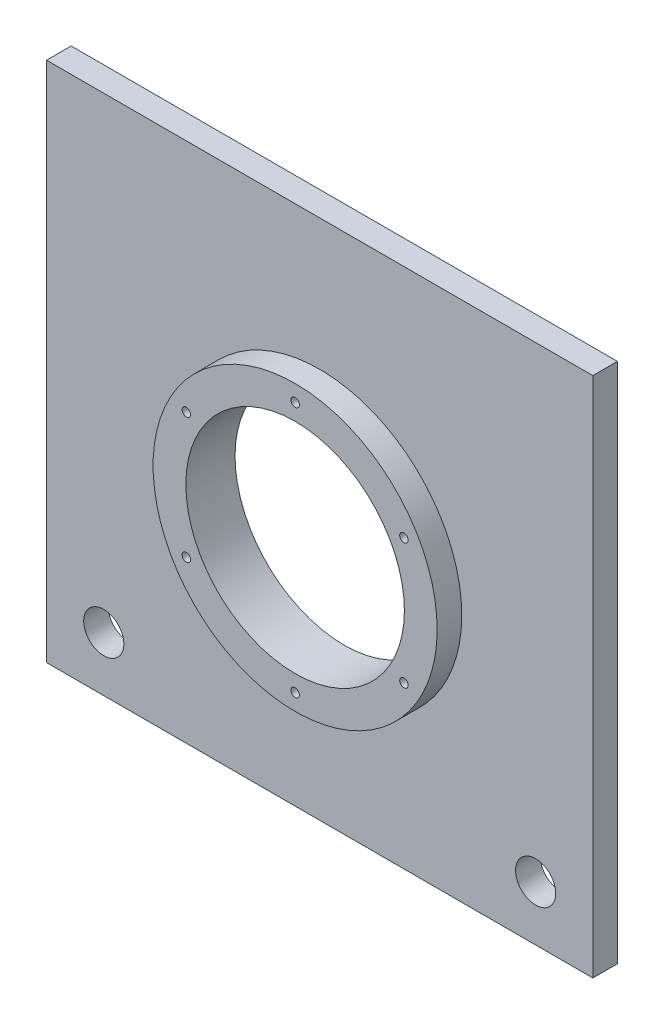
ISO-10303-21;
HEADER;
FILE_DESCRIPTION(('STEP AP214'),'2;1');
FILE_NAME('part.step','',(''),(''),'','','');
FILE_SCHEMA(('AUTOMOTIVE_DESIGN { 1 0 10303 214 1 1 1 1 }'));
ENDSEC;
DATA;
#1=APPLICATION_CONTEXT('core data for automotive mechanical design processes');
#2=APPLICATION_PROTOCOL_DEFINITION('international standard','automotive_design',2000,#1);
#3=PRODUCT_CONTEXT('',#1,'mechanical');
#4=PRODUCT('Part','Part','',(#3));
#5=PRODUCT_RELATED_PRODUCT_CATEGORY('part','',(#4));
#6=PRODUCT_DEFINITION_FORMATION('','',#4);
#7=PRODUCT_DEFINITION_CONTEXT('part definition',#1,'design');
#8=PRODUCT_DEFINITION('design','',#6,#7);
#9=PRODUCT_DEFINITION_SHAPE('','',#8);
#10=(LENGTH_UNIT() NAMED_UNIT(*) SI_UNIT(.MILLI.,.METRE.));
#11=(NAMED_UNIT(*) PLANE_ANGLE_UNIT() SI_UNIT($,.RADIAN.));
#12=(NAMED_UNIT(*) SI_UNIT($,.STERADIAN.) SOLID_ANGLE_UNIT());
#13=UNCERTAINTY_MEASURE_WITH_UNIT(LENGTH_MEASURE(1.E-05),#10,'distance_accuracy_value','');
#14=(GEOMETRIC_REPRESENTATION_CONTEXT(3) GLOBAL_UNCERTAINTY_ASSIGNED_CONTEXT((#13)) GLOBAL_UNIT_ASSIGNED_CONTEXT((#10,
#11,#12)) REPRESENTATION_CONTEXT('',''));
#15=CARTESIAN_POINT('',(0.,0.,0.));
#16=DIRECTION('',(0.,0.,1.));
#17=DIRECTION('',(1.,0.,0.));
#18=AXIS2_PLACEMENT_3D('',#15,#16,#17);
#19=CARTESIAN_POINT('',(0.,0.,9.));
#20=DIRECTION('',(0.,0.,1.));
#21=DIRECTION('',(1.,0.,0.));
#22=AXIS2_PLACEMENT_3D('',#19,#20,#21);
#23=PLANE('',#22);
#24=CARTESIAN_POINT('',(79.0575916230372,-75.4999999999996,9.));
#25=DIRECTION('',(0.,0.,1.));
#26=DIRECTION('',(-1.,0.,0.));
#27=AXIS2_PLACEMENT_3D('',#24,#25,#26);
#28=CIRCLE('',#27,7.34999999999999);
#29=CARTESIAN_POINT('',(71.7075916230372,-75.4999999999996,9.));
#30=VERTEX_POINT('',#29);
#31=EDGE_CURVE('E149',#30,#30,#28,.T.);
#32=ORIENTED_EDGE('',*,*,#31,.F.);
#33=EDGE_LOOP('',(#32));
#34=FACE_BOUND('',#33,.T.);
#35=DIRECTION('',(0.,1.,0.));
#36=VECTOR('',#35,1.);
#37=CARTESIAN_POINT('',(100.,95.5,9.));
#38=LINE('',#37,#36);
#39=CARTESIAN_POINT('',(100.,-95.5,9.));
#40=VERTEX_POINT('',#39);
#41=CARTESIAN_POINT('',(100.,95.5,9.));
#42=VERTEX_POINT('',#41);
#43=EDGE_CURVE('E98',#40,#42,#38,.T.);
#44=ORIENTED_EDGE('',*,*,#43,.T.);
#45=DIRECTION('',(-1.,0.,0.));
#46=VECTOR('',#45,1.);
#47=CARTESIAN_POINT('',(-100.,95.5,9.));
#48=LINE('',#47,#46);
#49=CARTESIAN_POINT('',(-100.,95.5,9.));
#50=VERTEX_POINT('',#49);
#51=EDGE_CURVE('E93',#42,#50,#48,.T.);
#52=ORIENTED_EDGE('',*,*,#51,.T.);
#53=DIRECTION('',(0.,-1.,0.));
#54=VECTOR('',#53,1.);
#55=CARTESIAN_POINT('',(-100.,95.5,9.));
#56=LINE('',#55,#54);
#57=CARTESIAN_POINT('',(-100.,-95.5,9.));
#58=VERTEX_POINT('',#57);
#59=EDGE_CURVE('E96',#50,#58,#56,.T.);
#60=ORIENTED_EDGE('',*,*,#59,.T.);
#61=DIRECTION('',(1.,0.,0.));
#62=VECTOR('',#61,1.);
#63=CARTESIAN_POINT('',(-100.,-95.5,9.));
#64=LINE('',#63,#62);
#65=EDGE_CURVE('E63',#58,#40,#64,.T.);
#66=ORIENTED_EDGE('',*,*,#65,.T.);
#67=EDGE_LOOP('',(#44,#52,#60,#66));
#68=FACE_BOUND('',#67,.T.);
#69=CARTESIAN_POINT('',(-79.0575916230366,-75.5,9.));
#70=DIRECTION('',(0.,0.,1.));
#71=DIRECTION('',(1.,0.,0.));
#72=AXIS2_PLACEMENT_3D('',#69,#70,#71);
#73=CIRCLE('',#72,7.34999999999999);
#74=CARTESIAN_POINT('',(-71.7075916230366,-75.5,9.));
#75=VERTEX_POINT('',#74);
#76=EDGE_CURVE('E142',#75,#75,#73,.T.);
#77=ORIENTED_EDGE('',*,*,#76,.F.);
#78=EDGE_LOOP('',(#77));
#79=FACE_BOUND('',#78,.T.);
#80=CARTESIAN_POINT('',(0.,-4.5,9.));
#81=DIRECTION('',(0.,0.,1.));
#82=DIRECTION('',(1.,0.,0.));
#83=AXIS2_PLACEMENT_3D('',#80,#81,#82);
#84=CIRCLE('',#83,52.);
#85=CARTESIAN_POINT('',(52.,-4.5,9.));
#86=VERTEX_POINT('',#85);
#87=EDGE_CURVE('E159',#86,#86,#84,.T.);
#88=ORIENTED_EDGE('',*,*,#87,.F.);
#89=EDGE_LOOP('',(#88));
#90=FACE_BOUND('',#89,.T.);
#91=ADVANCED_FACE('F46',(#34,#68,#79,#90),#23,.T.);
#92=CARTESIAN_POINT('',(0.,0.,0.));
#93=DIRECTION('',(0.,0.,1.));
#94=DIRECTION('',(1.,0.,0.));
#95=AXIS2_PLACEMENT_3D('',#92,#93,#94);
#96=PLANE('',#95);
#97=DIRECTION('',(0.,1.,0.));
#98=VECTOR('',#97,1.);
#99=CARTESIAN_POINT('',(100.,95.5,0.));
#100=LINE('',#99,#98);
#101=CARTESIAN_POINT('',(100.,-95.5,0.));
#102=VERTEX_POINT('',#101);
#103=CARTESIAN_POINT('',(100.,95.5,0.));
#104=VERTEX_POINT('',#103);
#105=EDGE_CURVE('E110',#102,#104,#100,.T.);
#106=ORIENTED_EDGE('',*,*,#105,.F.);
#107=DIRECTION('',(1.,0.,0.));
#108=VECTOR('',#107,1.);
#109=CARTESIAN_POINT('',(-100.,-95.5,0.));
#110=LINE('',#109,#108);
#111=CARTESIAN_POINT('',(-100.,-95.5,0.));
#112=VERTEX_POINT('',#111);
#113=EDGE_CURVE('E86',#112,#102,#110,.T.);
#114=ORIENTED_EDGE('',*,*,#113,.F.);
#115=DIRECTION('',(0.,-1.,0.));
#116=VECTOR('',#115,1.);
#117=CARTESIAN_POINT('',(-100.,95.5,0.));
#118=LINE('',#117,#116);
#119=CARTESIAN_POINT('',(-100.,95.5,0.));
#120=VERTEX_POINT('',#119);
#121=EDGE_CURVE('E80',#120,#112,#118,.T.);
#122=ORIENTED_EDGE('',*,*,#121,.F.);
#123=DIRECTION('',(-1.,0.,0.));
#124=VECTOR('',#123,1.);
#125=CARTESIAN_POINT('',(-100.,95.5,0.));
#126=LINE('',#125,#124);
#127=EDGE_CURVE('E102',#104,#120,#126,.T.);
#128=ORIENTED_EDGE('',*,*,#127,.F.);
#129=EDGE_LOOP('',(#106,#114,#122,#128));
#130=FACE_BOUND('',#129,.T.);
#131=CARTESIAN_POINT('',(0.,-4.5,0.));
#132=DIRECTION('',(0.,0.,1.));
#133=DIRECTION('',(1.,0.,0.));
#134=AXIS2_PLACEMENT_3D('',#131,#132,#133);
#135=CIRCLE('',#134,40.);
#136=CARTESIAN_POINT('',(40.,-4.5,0.));
#137=VERTEX_POINT('',#136);
#138=EDGE_CURVE('E115',#137,#137,#135,.T.);
#139=ORIENTED_EDGE('',*,*,#138,.T.);
#140=EDGE_LOOP('',(#139));
#141=FACE_BOUND('',#140,.T.);
#142=CARTESIAN_POINT('',(-79.0575916230366,-75.5,0.));
#143=DIRECTION('',(0.,0.,1.));
#144=DIRECTION('',(1.,0.,0.));
#145=AXIS2_PLACEMENT_3D('',#142,#143,#144);
#146=CIRCLE('',#145,7.34999999999999);
#147=CARTESIAN_POINT('',(-71.7075916230366,-75.5,0.));
#148=VERTEX_POINT('',#147);
#149=EDGE_CURVE('E143',#148,#148,#146,.T.);
#150=ORIENTED_EDGE('',*,*,#149,.T.);
#151=EDGE_LOOP('',(#150));
#152=FACE_BOUND('',#151,.T.);
#153=CARTESIAN_POINT('',(79.0575916230372,-75.4999999999996,0.));
#154=DIRECTION('',(0.,0.,1.));
#155=DIRECTION('',(-1.,0.,0.));
#156=AXIS2_PLACEMENT_3D('',#153,#154,#155);
#157=CIRCLE('',#156,7.34999999999999);
#158=CARTESIAN_POINT('',(71.7075916230372,-75.4999999999996,0.));
#159=VERTEX_POINT('',#158);
#160=EDGE_CURVE('E151',#159,#159,#157,.T.);
#161=ORIENTED_EDGE('',*,*,#160,.T.);
#162=EDGE_LOOP('',(#161));
#163=FACE_BOUND('',#162,.T.);
#164=ADVANCED_FACE('F134',(#130,#141,#152,#163),#96,.F.);
#165=CARTESIAN_POINT('',(100.,95.5,9.));
#166=DIRECTION('',(-1.,0.,0.));
#167=DIRECTION('',(0.,-1.,0.));
#168=AXIS2_PLACEMENT_3D('',#165,#166,#167);
#169=PLANE('',#168);
#170=ORIENTED_EDGE('',*,*,#105,.T.);
#171=DIRECTION('',(0.,0.,-1.));
#172=VECTOR('',#171,1.);
#173=CARTESIAN_POINT('',(100.,95.5,9.));
#174=LINE('',#173,#172);
#175=EDGE_CURVE('E12',#42,#104,#174,.T.);
#176=ORIENTED_EDGE('',*,*,#175,.F.);
#177=ORIENTED_EDGE('',*,*,#43,.F.);
#178=DIRECTION('',(0.,0.,-1.));
#179=VECTOR('',#178,1.);
#180=CARTESIAN_POINT('',(100.,-95.5,9.));
#181=LINE('',#180,#179);
#182=EDGE_CURVE('E106',#40,#102,#181,.T.);
#183=ORIENTED_EDGE('',*,*,#182,.T.);
#184=EDGE_LOOP('',(#170,#176,#177,#183));
#185=FACE_BOUND('',#184,.T.);
#186=ADVANCED_FACE('F48',(#185),#169,.F.);
#187=CARTESIAN_POINT('',(-100.,95.5,9.));
#188=DIRECTION('',(0.,-1.,0.));
#189=DIRECTION('',(0.,0.,-1.));
#190=AXIS2_PLACEMENT_3D('',#187,#188,#189);
#191=PLANE('',#190);
#192=ORIENTED_EDGE('',*,*,#127,.T.);
#193=DIRECTION('',(0.,0.,-1.));
#194=VECTOR('',#193,1.);
#195=CARTESIAN_POINT('',(-100.,95.5,9.));
#196=LINE('',#195,#194);
#197=EDGE_CURVE('E55',#50,#120,#196,.T.);
#198=ORIENTED_EDGE('',*,*,#197,.F.);
#199=ORIENTED_EDGE('',*,*,#51,.F.);
#200=ORIENTED_EDGE('',*,*,#175,.T.);
#201=EDGE_LOOP('',(#192,#198,#199,#200));
#202=FACE_BOUND('',#201,.T.);
#203=ADVANCED_FACE('F101',(#202),#191,.F.);
#204=CARTESIAN_POINT('',(-100.,95.5,9.));
#205=DIRECTION('',(1.,0.,0.));
#206=DIRECTION('',(0.,1.,0.));
#207=AXIS2_PLACEMENT_3D('',#204,#205,#206);
#208=PLANE('',#207);
#209=ORIENTED_EDGE('',*,*,#121,.T.);
#210=DIRECTION('',(0.,0.,-1.));
#211=VECTOR('',#210,1.);
#212=CARTESIAN_POINT('',(-100.,-95.5,9.));
#213=LINE('',#212,#211);
#214=EDGE_CURVE('E103',#58,#112,#213,.T.);
#215=ORIENTED_EDGE('',*,*,#214,.F.);
#216=ORIENTED_EDGE('',*,*,#59,.F.);
#217=ORIENTED_EDGE('',*,*,#197,.T.);
#218=EDGE_LOOP('',(#209,#215,#216,#217));
#219=FACE_BOUND('',#218,.T.);
#220=ADVANCED_FACE('F104',(#219),#208,.F.);
#221=CARTESIAN_POINT('',(-100.,-95.5,9.));
#222=DIRECTION('',(0.,1.,0.));
#223=DIRECTION('',(0.,0.,1.));
#224=AXIS2_PLACEMENT_3D('',#221,#222,#223);
#225=PLANE('',#224);
#226=ORIENTED_EDGE('',*,*,#113,.T.);
#227=ORIENTED_EDGE('',*,*,#182,.F.);
#228=ORIENTED_EDGE('',*,*,#65,.F.);
#229=ORIENTED_EDGE('',*,*,#214,.T.);
#230=EDGE_LOOP('',(#226,#227,#228,#229));
#231=FACE_BOUND('',#230,.T.);
#232=ADVANCED_FACE('F131',(#231),#225,.F.);
#233=CARTESIAN_POINT('',(0.,-4.5,9.));
#234=DIRECTION('',(0.,0.,-1.));
#235=DIRECTION('',(-1.,0.,0.));
#236=AXIS2_PLACEMENT_3D('',#233,#234,#235);
#237=CYLINDRICAL_SURFACE('',#236,40.);
#238=ORIENTED_EDGE('',*,*,#138,.F.);
#239=EDGE_LOOP('',(#238));
#240=FACE_BOUND('',#239,.T.);
#241=CARTESIAN_POINT('',(0.,-4.5,18.));
#242=DIRECTION('',(0.,0.,1.));
#243=DIRECTION('',(1.,0.,0.));
#244=AXIS2_PLACEMENT_3D('',#241,#242,#243);
#245=CIRCLE('',#244,40.);
#246=CARTESIAN_POINT('',(40.,-4.5,18.));
#247=VERTEX_POINT('',#246);
#248=EDGE_CURVE('E162',#247,#247,#245,.T.);
#249=ORIENTED_EDGE('',*,*,#248,.T.);
#250=EDGE_LOOP('',(#249));
#251=FACE_BOUND('',#250,.T.);
#252=ADVANCED_FACE('F230',(#240,#251),#237,.F.);
#253=CARTESIAN_POINT('',(-79.0575916230366,-75.5,9.));
#254=DIRECTION('',(0.,0.,-1.));
#255=DIRECTION('',(-1.,0.,0.));
#256=AXIS2_PLACEMENT_3D('',#253,#254,#255);
#257=CYLINDRICAL_SURFACE('',#256,7.34999999999999);
#258=ORIENTED_EDGE('',*,*,#76,.T.);
#259=EDGE_LOOP('',(#258));
#260=FACE_BOUND('',#259,.T.);
#261=ORIENTED_EDGE('',*,*,#149,.F.);
#262=EDGE_LOOP('',(#261));
#263=FACE_BOUND('',#262,.T.);
#264=ADVANCED_FACE('F246',(#260,#263),#257,.F.);
#265=CARTESIAN_POINT('',(79.0575916230372,-75.4999999999996,9.));
#266=DIRECTION('',(0.,0.,-1.));
#267=DIRECTION('',(-1.,0.,0.));
#268=AXIS2_PLACEMENT_3D('',#265,#266,#267);
#269=CYLINDRICAL_SURFACE('',#268,7.34999999999999);
#270=ORIENTED_EDGE('',*,*,#31,.T.);
#271=EDGE_LOOP('',(#270));
#272=FACE_BOUND('',#271,.T.);
#273=ORIENTED_EDGE('',*,*,#160,.F.);
#274=EDGE_LOOP('',(#273));
#275=FACE_BOUND('',#274,.T.);
#276=ADVANCED_FACE('F235',(#272,#275),#269,.F.);
#277=CARTESIAN_POINT('',(0.,-4.5,18.));
#278=DIRECTION('',(0.,0.,1.));
#279=DIRECTION('',(1.,0.,0.));
#280=AXIS2_PLACEMENT_3D('',#277,#278,#279);
#281=PLANE('',#280);
#282=CARTESIAN_POINT('',(6.89507804351655E-10,41.5,18.));
#283=DIRECTION('',(0.,0.,1.));
#284=DIRECTION('',(1.,0.,0.));
#285=AXIS2_PLACEMENT_3D('',#282,#283,#284);
#286=CIRCLE('',#285,1.55);
#287=CARTESIAN_POINT('',(1.55000000068951,41.5,18.));
#288=VERTEX_POINT('',#287);
#289=EDGE_CURVE('E179',#288,#288,#286,.T.);
#290=ORIENTED_EDGE('',*,*,#289,.F.);
#291=EDGE_LOOP('',(#290));
#292=FACE_BOUND('',#291,.T.);
#293=CARTESIAN_POINT('',(-39.8371685740842,18.5,18.));
#294=DIRECTION('',(0.,0.,1.));
#295=DIRECTION('',(1.,0.,0.));
#296=AXIS2_PLACEMENT_3D('',#293,#294,#295);
#297=CIRCLE('',#296,1.55);
#298=CARTESIAN_POINT('',(-38.2871685740842,18.5,18.));
#299=VERTEX_POINT('',#298);
#300=EDGE_CURVE('E208',#299,#299,#297,.T.);
#301=ORIENTED_EDGE('',*,*,#300,.F.);
#302=EDGE_LOOP('',(#301));
#303=FACE_BOUND('',#302,.T.);
#304=CARTESIAN_POINT('',(-39.8371685740842,-27.5,18.));
#305=DIRECTION('',(0.,0.,1.));
#306=DIRECTION('',(1.,0.,0.));
#307=AXIS2_PLACEMENT_3D('',#304,#305,#306);
#308=CIRCLE('',#307,1.55);
#309=CARTESIAN_POINT('',(-38.2871685740842,-27.5,18.));
#310=VERTEX_POINT('',#309);
#311=EDGE_CURVE('E202',#310,#310,#308,.T.);
#312=ORIENTED_EDGE('',*,*,#311,.F.);
#313=EDGE_LOOP('',(#312));
#314=FACE_BOUND('',#313,.T.);
#315=CARTESIAN_POINT('',(0.,-50.5,18.));
#316=DIRECTION('',(0.,0.,1.));
#317=DIRECTION('',(1.,0.,0.));
#318=AXIS2_PLACEMENT_3D('',#315,#316,#317);
#319=CIRCLE('',#318,1.55);
#320=CARTESIAN_POINT('',(1.55,-50.5,18.));
#321=VERTEX_POINT('',#320);
#322=EDGE_CURVE('E192',#321,#321,#319,.T.);
#323=ORIENTED_EDGE('',*,*,#322,.F.);
#324=EDGE_LOOP('',(#323));
#325=FACE_BOUND('',#324,.T.);
#326=CARTESIAN_POINT('',(39.8371685740842,-27.5,18.));
#327=DIRECTION('',(0.,0.,1.));
#328=DIRECTION('',(1.,0.,0.));
#329=AXIS2_PLACEMENT_3D('',#326,#327,#328);
#330=CIRCLE('',#329,1.55);
#331=CARTESIAN_POINT('',(41.3871685740842,-27.5,18.));
#332=VERTEX_POINT('',#331);
#333=EDGE_CURVE('E184',#332,#332,#330,.T.);
#334=ORIENTED_EDGE('',*,*,#333,.F.);
#335=EDGE_LOOP('',(#334));
#336=FACE_BOUND('',#335,.T.);
#337=CARTESIAN_POINT('',(39.8371685740842,18.5,18.));
#338=DIRECTION('',(0.,0.,1.));
#339=DIRECTION('',(1.,0.,0.));
#340=AXIS2_PLACEMENT_3D('',#337,#338,#339);
#341=CIRCLE('',#340,1.55);
#342=CARTESIAN_POINT('',(41.3871685740842,18.5,18.));
#343=VERTEX_POINT('',#342);
#344=EDGE_CURVE('E173',#343,#343,#341,.T.);
#345=ORIENTED_EDGE('',*,*,#344,.F.);
#346=EDGE_LOOP('',(#345));
#347=FACE_BOUND('',#346,.T.);
#348=CARTESIAN_POINT('',(0.,-4.5,18.));
#349=DIRECTION('',(0.,0.,1.));
#350=DIRECTION('',(1.,0.,0.));
#351=AXIS2_PLACEMENT_3D('',#348,#349,#350);
#352=CIRCLE('',#351,52.);
#353=CARTESIAN_POINT('',(52.,-4.5,18.));
#354=VERTEX_POINT('',#353);
#355=EDGE_CURVE('E156',#354,#354,#352,.T.);
#356=ORIENTED_EDGE('',*,*,#355,.T.);
#357=EDGE_LOOP('',(#356));
#358=FACE_BOUND('',#357,.T.);
#359=ORIENTED_EDGE('',*,*,#248,.F.);
#360=EDGE_LOOP('',(#359));
#361=FACE_BOUND('',#360,.T.);
#362=ADVANCED_FACE('F232',(#292,#303,#314,#325,#336,#347,#358,#361),#281,.T.);
#363=CARTESIAN_POINT('',(0.,-4.5,18.));
#364=DIRECTION('',(0.,0.,-1.));
#365=DIRECTION('',(-1.,0.,0.));
#366=AXIS2_PLACEMENT_3D('',#363,#364,#365);
#367=CYLINDRICAL_SURFACE('',#366,52.);
#368=ORIENTED_EDGE('',*,*,#355,.F.);
#369=EDGE_LOOP('',(#368));
#370=FACE_BOUND('',#369,.T.);
#371=ORIENTED_EDGE('',*,*,#87,.T.);
#372=EDGE_LOOP('',(#371));
#373=FACE_BOUND('',#372,.T.);
#374=ADVANCED_FACE('F234',(#370,#373),#367,.T.);
#375=CARTESIAN_POINT('',(39.8371685740842,18.5,9.));
#376=DIRECTION('',(0.,0.,1.));
#377=DIRECTION('',(1.,0.,0.));
#378=AXIS2_PLACEMENT_3D('',#375,#376,#377);
#379=CYLINDRICAL_SURFACE('',#378,1.55);
#380=CARTESIAN_POINT('',(39.8371685740842,18.5,9.));
#381=DIRECTION('',(0.,0.,1.));
#382=DIRECTION('',(1.,0.,0.));
#383=AXIS2_PLACEMENT_3D('',#380,#381,#382);
#384=CIRCLE('',#383,1.55);
#385=CARTESIAN_POINT('',(41.3871685740842,18.5,9.));
#386=VERTEX_POINT('',#385);
#387=EDGE_CURVE('E180',#386,#386,#384,.T.);
#388=ORIENTED_EDGE('',*,*,#387,.F.);
#389=EDGE_LOOP('',(#388));
#390=FACE_BOUND('',#389,.T.);
#391=ORIENTED_EDGE('',*,*,#344,.T.);
#392=EDGE_LOOP('',(#391));
#393=FACE_BOUND('',#392,.T.);
#394=ADVANCED_FACE('F242',(#390,#393),#379,.F.);
#395=CARTESIAN_POINT('',(39.8371685740842,18.5,9.));
#396=DIRECTION('',(0.,0.,1.));
#397=DIRECTION('',(1.,0.,0.));
#398=AXIS2_PLACEMENT_3D('',#395,#396,#397);
#399=PLANE('',#398);
#400=ORIENTED_EDGE('',*,*,#387,.T.);
#401=EDGE_LOOP('',(#400));
#402=FACE_BOUND('',#401,.T.);
#403=ADVANCED_FACE('F333',(#402),#399,.T.);
#404=CARTESIAN_POINT('',(39.8371685740842,-27.5,9.));
#405=DIRECTION('',(0.,0.,1.));
#406=DIRECTION('',(1.,0.,0.));
#407=AXIS2_PLACEMENT_3D('',#404,#405,#406);
#408=CYLINDRICAL_SURFACE('',#407,1.55);
#409=CARTESIAN_POINT('',(39.8371685740842,-27.5,9.));
#410=DIRECTION('',(0.,0.,1.));
#411=DIRECTION('',(1.,0.,0.));
#412=AXIS2_PLACEMENT_3D('',#409,#410,#411);
#413=CIRCLE('',#412,1.55);
#414=CARTESIAN_POINT('',(41.3871685740842,-27.5,9.));
#415=VERTEX_POINT('',#414);
#416=EDGE_CURVE('E189',#415,#415,#413,.T.);
#417=ORIENTED_EDGE('',*,*,#416,.F.);
#418=EDGE_LOOP('',(#417));
#419=FACE_BOUND('',#418,.T.);
#420=ORIENTED_EDGE('',*,*,#333,.T.);
#421=EDGE_LOOP('',(#420));
#422=FACE_BOUND('',#421,.T.);
#423=ADVANCED_FACE('F342',(#419,#422),#408,.F.);
#424=CARTESIAN_POINT('',(39.8371685740842,-27.5,9.));
#425=DIRECTION('',(0.,0.,1.));
#426=DIRECTION('',(1.,0.,0.));
#427=AXIS2_PLACEMENT_3D('',#424,#425,#426);
#428=PLANE('',#427);
#429=ORIENTED_EDGE('',*,*,#416,.T.);
#430=EDGE_LOOP('',(#429));
#431=FACE_BOUND('',#430,.T.);
#432=ADVANCED_FACE('F351',(#431),#428,.T.);
#433=CARTESIAN_POINT('',(0.,-50.5,9.));
#434=DIRECTION('',(0.,0.,1.));
#435=DIRECTION('',(1.,0.,0.));
#436=AXIS2_PLACEMENT_3D('',#433,#434,#435);
#437=CYLINDRICAL_SURFACE('',#436,1.55);
#438=CARTESIAN_POINT('',(0.,-50.5,9.));
#439=DIRECTION('',(0.,0.,1.));
#440=DIRECTION('',(1.,0.,0.));
#441=AXIS2_PLACEMENT_3D('',#438,#439,#440);
#442=CIRCLE('',#441,1.55);
#443=CARTESIAN_POINT('',(1.55,-50.5,9.));
#444=VERTEX_POINT('',#443);
#445=EDGE_CURVE('E197',#444,#444,#442,.T.);
#446=ORIENTED_EDGE('',*,*,#445,.F.);
#447=EDGE_LOOP('',(#446));
#448=FACE_BOUND('',#447,.T.);
#449=ORIENTED_EDGE('',*,*,#322,.T.);
#450=EDGE_LOOP('',(#449));
#451=FACE_BOUND('',#450,.T.);
#452=ADVANCED_FACE('F360',(#448,#451),#437,.F.);
#453=CARTESIAN_POINT('',(0.,-50.5,9.));
#454=DIRECTION('',(0.,0.,1.));
#455=DIRECTION('',(1.,0.,0.));
#456=AXIS2_PLACEMENT_3D('',#453,#454,#455);
#457=PLANE('',#456);
#458=ORIENTED_EDGE('',*,*,#445,.T.);
#459=EDGE_LOOP('',(#458));
#460=FACE_BOUND('',#459,.T.);
#461=ADVANCED_FACE('F369',(#460),#457,.T.);
#462=CARTESIAN_POINT('',(-39.8371685740842,-27.5,9.));
#463=DIRECTION('',(0.,0.,1.));
#464=DIRECTION('',(1.,0.,0.));
#465=AXIS2_PLACEMENT_3D('',#462,#463,#464);
#466=CYLINDRICAL_SURFACE('',#465,1.55);
#467=CARTESIAN_POINT('',(-39.8371685740842,-27.5,9.));
#468=DIRECTION('',(0.,0.,1.));
#469=DIRECTION('',(1.,0.,0.));
#470=AXIS2_PLACEMENT_3D('',#467,#468,#469);
#471=CIRCLE('',#470,1.55);
#472=CARTESIAN_POINT('',(-38.2871685740842,-27.5,9.));
#473=VERTEX_POINT('',#472);
#474=EDGE_CURVE('E206',#473,#473,#471,.T.);
#475=ORIENTED_EDGE('',*,*,#474,.F.);
#476=EDGE_LOOP('',(#475));
#477=FACE_BOUND('',#476,.T.);
#478=ORIENTED_EDGE('',*,*,#311,.T.);
#479=EDGE_LOOP('',(#478));
#480=FACE_BOUND('',#479,.T.);
#481=ADVANCED_FACE('F378',(#477,#480),#466,.F.);
#482=CARTESIAN_POINT('',(-39.8371685740842,-27.5,9.));
#483=DIRECTION('',(0.,0.,1.));
#484=DIRECTION('',(1.,0.,0.));
#485=AXIS2_PLACEMENT_3D('',#482,#483,#484);
#486=PLANE('',#485);
#487=ORIENTED_EDGE('',*,*,#474,.T.);
#488=EDGE_LOOP('',(#487));
#489=FACE_BOUND('',#488,.T.);
#490=ADVANCED_FACE('F387',(#489),#486,.T.);
#491=CARTESIAN_POINT('',(-39.8371685740842,18.5,9.));
#492=DIRECTION('',(0.,0.,1.));
#493=DIRECTION('',(1.,0.,0.));
#494=AXIS2_PLACEMENT_3D('',#491,#492,#493);
#495=CYLINDRICAL_SURFACE('',#494,1.55);
#496=CARTESIAN_POINT('',(-39.8371685740842,18.5,9.));
#497=DIRECTION('',(0.,0.,1.));
#498=DIRECTION('',(1.,0.,0.));
#499=AXIS2_PLACEMENT_3D('',#496,#497,#498);
#500=CIRCLE('',#499,1.55);
#501=CARTESIAN_POINT('',(-38.2871685740842,18.5,9.));
#502=VERTEX_POINT('',#501);
#503=EDGE_CURVE('E181',#502,#502,#500,.T.);
#504=ORIENTED_EDGE('',*,*,#503,.F.);
#505=EDGE_LOOP('',(#504));
#506=FACE_BOUND('',#505,.T.);
#507=ORIENTED_EDGE('',*,*,#300,.T.);
#508=EDGE_LOOP('',(#507));
#509=FACE_BOUND('',#508,.T.);
#510=ADVANCED_FACE('F396',(#506,#509),#495,.F.);
#511=CARTESIAN_POINT('',(-39.8371685740842,18.5,9.));
#512=DIRECTION('',(0.,0.,1.));
#513=DIRECTION('',(1.,0.,0.));
#514=AXIS2_PLACEMENT_3D('',#511,#512,#513);
#515=PLANE('',#514);
#516=ORIENTED_EDGE('',*,*,#503,.T.);
#517=EDGE_LOOP('',(#516));
#518=FACE_BOUND('',#517,.T.);
#519=ADVANCED_FACE('F403',(#518),#515,.T.);
#520=CARTESIAN_POINT('',(6.89507804351655E-10,41.5,9.));
#521=DIRECTION('',(0.,0.,1.));
#522=DIRECTION('',(1.,0.,0.));
#523=AXIS2_PLACEMENT_3D('',#520,#521,#522);
#524=CYLINDRICAL_SURFACE('',#523,1.55);
#525=CARTESIAN_POINT('',(6.89507804351655E-10,41.5,9.));
#526=DIRECTION('',(0.,0.,1.));
#527=DIRECTION('',(1.,0.,0.));
#528=AXIS2_PLACEMENT_3D('',#525,#526,#527);
#529=CIRCLE('',#528,1.55);
#530=CARTESIAN_POINT('',(1.55000000068951,41.5,9.));
#531=VERTEX_POINT('',#530);
#532=EDGE_CURVE('E222',#531,#531,#529,.T.);
#533=ORIENTED_EDGE('',*,*,#532,.F.);
#534=EDGE_LOOP('',(#533));
#535=FACE_BOUND('',#534,.T.);
#536=ORIENTED_EDGE('',*,*,#289,.T.);
#537=EDGE_LOOP('',(#536));
#538=FACE_BOUND('',#537,.T.);
#539=ADVANCED_FACE('F412',(#535,#538),#524,.F.);
#540=CARTESIAN_POINT('',(6.89507804351655E-10,41.5,9.));
#541=DIRECTION('',(0.,0.,1.));
#542=DIRECTION('',(1.,0.,0.));
#543=AXIS2_PLACEMENT_3D('',#540,#541,#542);
#544=PLANE('',#543);
#545=ORIENTED_EDGE('',*,*,#532,.T.);
#546=EDGE_LOOP('',(#545));
#547=FACE_BOUND('',#546,.T.);
#548=ADVANCED_FACE('F421',(#547),#544,.T.);
#549=CLOSED_SHELL('',(#91,#164,#186,#203,#220,#232,#252,#264,#276,#362,#374,#394,#403,#423,#432,
#452,#461,#481,#490,#510,#519,#539,#548));
#550=MANIFOLD_SOLID_BREP('B2',#549);
#551=ADVANCED_BREP_SHAPE_REPRESENTATION('',(#18,#550),#14);
#552=SHAPE_DEFINITION_REPRESENTATION(#9,#551);
ENDSEC;
END-ISO-10303-21;
